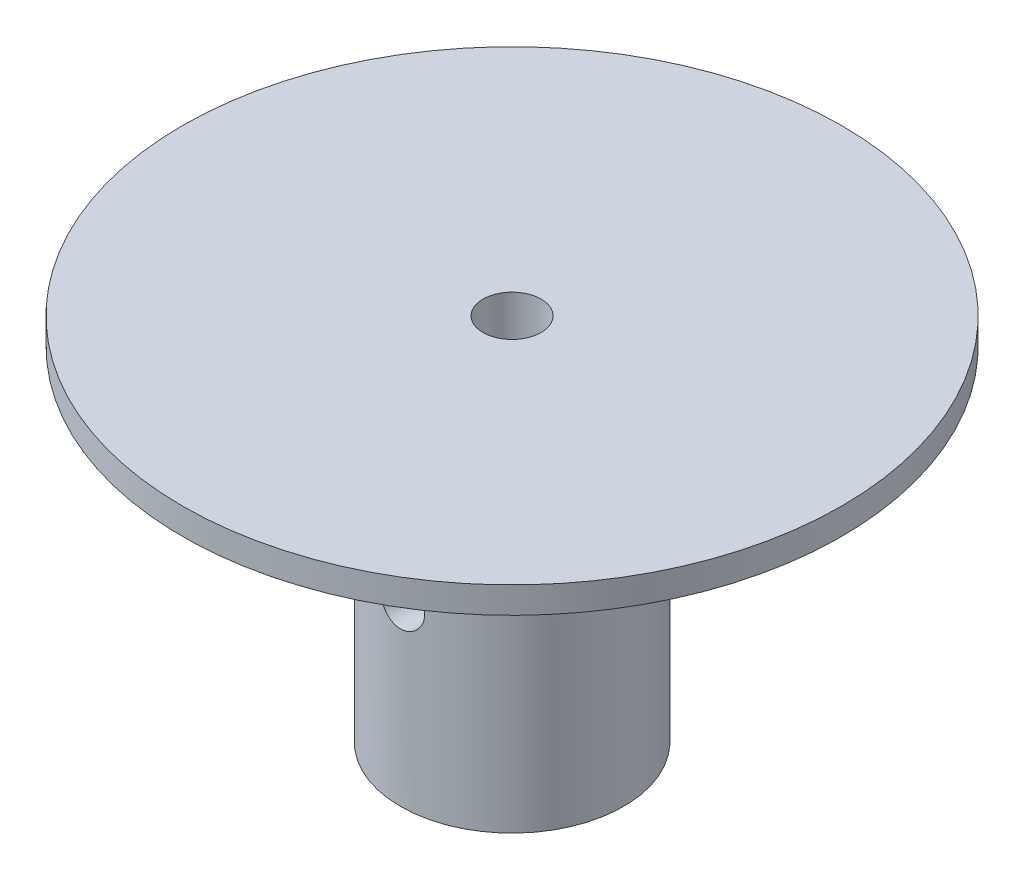
ISO-10303-21;
HEADER;
FILE_DESCRIPTION(('STEP AP214'),'2;1');
FILE_NAME('part.step','',(''),(''),'','','');
FILE_SCHEMA(('AUTOMOTIVE_DESIGN { 1 0 10303 214 1 1 1 1 }'));
ENDSEC;
DATA;
#1=APPLICATION_CONTEXT('core data for automotive mechanical design processes');
#2=APPLICATION_PROTOCOL_DEFINITION('international standard','automotive_design',2000,#1);
#3=PRODUCT_CONTEXT('',#1,'mechanical');
#4=PRODUCT('Part','Part','',(#3));
#5=PRODUCT_RELATED_PRODUCT_CATEGORY('part','',(#4));
#6=PRODUCT_DEFINITION_FORMATION('','',#4);
#7=PRODUCT_DEFINITION_CONTEXT('part definition',#1,'design');
#8=PRODUCT_DEFINITION('design','',#6,#7);
#9=PRODUCT_DEFINITION_SHAPE('','',#8);
#10=(LENGTH_UNIT() NAMED_UNIT(*) SI_UNIT(.MILLI.,.METRE.));
#11=(NAMED_UNIT(*) PLANE_ANGLE_UNIT() SI_UNIT($,.RADIAN.));
#12=(NAMED_UNIT(*) SI_UNIT($,.STERADIAN.) SOLID_ANGLE_UNIT());
#13=UNCERTAINTY_MEASURE_WITH_UNIT(LENGTH_MEASURE(1.E-05),#10,'distance_accuracy_value','');
#14=(GEOMETRIC_REPRESENTATION_CONTEXT(3) GLOBAL_UNCERTAINTY_ASSIGNED_CONTEXT((#13)) GLOBAL_UNIT_ASSIGNED_CONTEXT((#10,
#11,#12)) REPRESENTATION_CONTEXT('',''));
#15=CARTESIAN_POINT('',(0.,0.,0.));
#16=DIRECTION('',(0.,0.,1.));
#17=DIRECTION('',(1.,0.,0.));
#18=AXIS2_PLACEMENT_3D('',#15,#16,#17);
#19=CARTESIAN_POINT('',(0.,40.,0.));
#20=DIRECTION('',(0.,-1.,0.));
#21=DIRECTION('',(0.,0.,-1.));
#22=AXIS2_PLACEMENT_3D('',#19,#20,#21);
#23=CYLINDRICAL_SURFACE('',#22,12.7);
#24=CARTESIAN_POINT('',(0.,39.,0.));
#25=DIRECTION('',(0.,-1.,0.));
#26=DIRECTION('',(0.,0.,-1.));
#27=AXIS2_PLACEMENT_3D('',#24,#25,#26);
#28=CIRCLE('',#27,12.7);
#29=CARTESIAN_POINT('',(0.,39.,-12.7));
#30=VERTEX_POINT('',#29);
#31=EDGE_CURVE('E118',#30,#30,#28,.T.);
#32=ORIENTED_EDGE('',*,*,#31,.T.);
#33=EDGE_LOOP('',(#32));
#34=FACE_BOUND('',#33,.T.);
#35=CARTESIAN_POINT('',(0.,22.5,-12.7));
#36=CARTESIAN_POINT('',(-0.138987960865234,22.499994833943,-12.6999974468811));
#37=CARTESIAN_POINT('',(-0.278041713614196,22.4883702446647,-12.6976949339189));
#38=CARTESIAN_POINT('',(-0.552221840666648,22.4422141497609,-12.6887318036794));
#39=CARTESIAN_POINT('',(-0.687344952752516,22.4076641533403,-12.6820676685364));
#40=CARTESIAN_POINT('',(-0.949659697043477,22.3167634099156,-12.6651257812117));
#41=CARTESIAN_POINT('',(-1.07685868370594,22.2604332381561,-12.6548514403439));
#42=CARTESIAN_POINT('',(-1.31999070721838,22.1276315968935,-12.6318073542676));
#43=CARTESIAN_POINT('',(-1.43592447607421,22.0511614372721,-12.6190377713609));
#44=CARTESIAN_POINT('',(-1.65476803302417,21.879184913606,-12.5922220522898));
#45=CARTESIAN_POINT('',(-1.75750845008173,21.7834650672187,-12.5781626589771));
#46=CARTESIAN_POINT('',(-1.94558265987402,21.5761653040664,-12.5504488475412));
#47=CARTESIAN_POINT('',(-2.03091512197415,21.4645841759972,-12.5367944604441));
#48=CARTESIAN_POINT('',(-2.18246782558671,21.227516414781,-12.5113073631306));
#49=CARTESIAN_POINT('',(-2.24851348505254,21.1019161778105,-12.4994917196969));
#50=CARTESIAN_POINT('',(-2.35849956917044,20.8411305841508,-12.4792078209969));
#51=CARTESIAN_POINT('',(-2.40244210553341,20.7059461445354,-12.4707392459716));
#52=CARTESIAN_POINT('',(-2.46642634199944,20.4316492554968,-12.4582422803737));
#53=CARTESIAN_POINT('',(-2.48676474883637,20.2926085776543,-12.4541588183279));
#54=CARTESIAN_POINT('',(-2.50388482784342,20.0130330483538,-12.4507285909527));
#55=CARTESIAN_POINT('',(-2.50066883198495,19.8724983461853,-12.4513813567195));
#56=CARTESIAN_POINT('',(-2.47101146674484,19.596089327001,-12.4572997676681));
#57=CARTESIAN_POINT('',(-2.44490952078092,19.4601769331889,-12.4624979956958));
#58=CARTESIAN_POINT('',(-2.37075664445726,19.1946987657748,-12.4768155357255));
#59=CARTESIAN_POINT('',(-2.32270469551383,19.0651332870085,-12.4859350296917));
#60=CARTESIAN_POINT('',(-2.20568971494497,18.8150448093683,-12.5071368898427));
#61=CARTESIAN_POINT('',(-2.13659150045544,18.6945867440355,-12.5192383104004));
#62=CARTESIAN_POINT('',(-1.97954087249848,18.4668477222278,-12.5450281718732));
#63=CARTESIAN_POINT('',(-1.89158635727556,18.3595682367584,-12.5587167896218));
#64=CARTESIAN_POINT('',(-1.69749924075908,18.1592724337398,-12.5864311850058));
#65=CARTESIAN_POINT('',(-1.59107678296699,18.0665369977906,-12.6004586831339));
#66=CARTESIAN_POINT('',(-1.36403967125457,17.9001905415399,-12.6270518311294));
#67=CARTESIAN_POINT('',(-1.24342484607896,17.8265797520445,-12.6396174633531));
#68=CARTESIAN_POINT('',(-0.991119710985106,17.7005229032414,-12.6619004871253));
#69=CARTESIAN_POINT('',(-0.859413335279193,17.6481082058248,-12.6716136523715));
#70=CARTESIAN_POINT('',(-0.588830874890813,17.5662268760062,-12.6870651128115));
#71=CARTESIAN_POINT('',(-0.449955633135175,17.5367575521743,-12.6928038741834));
#72=CARTESIAN_POINT('',(-0.171392040916341,17.5019994294573,-12.6995952302307));
#73=CARTESIAN_POINT('',(-0.0317534277233666,17.4963261223005,-12.7007223350353));
#74=CARTESIAN_POINT('',(0.246476638338104,17.5082866111275,-12.6983700492024));
#75=CARTESIAN_POINT('',(0.385068147739182,17.5259191396664,-12.6948909090669));
#76=CARTESIAN_POINT('',(0.656034823048091,17.5836712660876,-12.6837636208141));
#77=CARTESIAN_POINT('',(0.788453517065809,17.6235942755498,-12.6761519352064));
#78=CARTESIAN_POINT('',(1.04471741581758,17.7245798107489,-12.6576098134253));
#79=CARTESIAN_POINT('',(1.16856199253419,17.7856438830167,-12.646679134465));
#80=CARTESIAN_POINT('',(1.40578877801717,17.9280149261848,-12.6225258491849));
#81=CARTESIAN_POINT('',(1.51902884538163,18.0095542826313,-12.6092775014321));
#82=CARTESIAN_POINT('',(1.73035680232957,18.1902492864937,-12.5820204588253));
#83=CARTESIAN_POINT('',(1.82844311973421,18.2894067594713,-12.5680116852818));
#84=CARTESIAN_POINT('',(2.00815737604346,18.5042712458316,-12.5405625275439));
#85=CARTESIAN_POINT('',(2.08952174237709,18.6202004198395,-12.5271335480784));
#86=CARTESIAN_POINT('',(2.23162326975849,18.8643064308326,-12.5026028828179));
#87=CARTESIAN_POINT('',(2.29236124216583,18.9924827858087,-12.4915011054867));
#88=CARTESIAN_POINT('',(2.39112242068542,19.2568084040906,-12.4729732664571));
#89=CARTESIAN_POINT('',(2.42926140651535,19.3929130349882,-12.4655285032328));
#90=CARTESIAN_POINT('',(2.48209472746247,19.6697604868739,-12.4551171742591));
#91=CARTESIAN_POINT('',(2.49679201245609,19.8105027219959,-12.4521500450518));
#92=CARTESIAN_POINT('',(2.50221823341316,20.0899855439399,-12.4510605246743));
#93=CARTESIAN_POINT('',(2.49336346367693,20.2287178885978,-12.4528539865424));
#94=CARTESIAN_POINT('',(2.45285380576288,20.5026744298686,-12.4608959273249));
#95=CARTESIAN_POINT('',(2.42119908817676,20.6378986527218,-12.4671443729065));
#96=CARTESIAN_POINT('',(2.33617123860446,20.9007460942606,-12.4833551743628));
#97=CARTESIAN_POINT('',(2.28284762082502,21.0283858865014,-12.4933090588546));
#98=CARTESIAN_POINT('',(2.15604281399342,21.2729727792321,-12.5158143109788));
#99=CARTESIAN_POINT('',(2.08256000241888,21.3899190180358,-12.5283658876678));
#100=CARTESIAN_POINT('',(1.91609430756191,21.611875251352,-12.5549107116211));
#101=CARTESIAN_POINT('',(1.82281018019679,21.7166569228888,-12.5689242991049));
#102=CARTESIAN_POINT('',(1.62001342859707,21.9092175370653,-12.5966666057201));
#103=CARTESIAN_POINT('',(1.51049708113706,21.9969925681635,-12.6103952586694));
#104=CARTESIAN_POINT('',(1.27701879640782,22.153881710985,-12.6361838431273));
#105=CARTESIAN_POINT('',(1.15292235481975,22.2227987681861,-12.6482255557717));
#106=CARTESIAN_POINT('',(0.894709355165153,22.3386927020578,-12.6691045662215));
#107=CARTESIAN_POINT('',(0.760602057026481,22.3856895699496,-12.6779447821414));
#108=CARTESIAN_POINT('',(0.521807507477838,22.4471931753729,-12.6896853850498));
#109=CARTESIAN_POINT('',(0.418489394757489,22.4669608090208,-12.6935309348549));
#110=CARTESIAN_POINT('',(0.21012668916486,22.4933659764926,-12.6986891693293));
#111=CARTESIAN_POINT('',(0.105082148392049,22.5000039058086,-12.7000019302911));
#112=CARTESIAN_POINT('',(0.,22.5,-12.7));
#113=B_SPLINE_CURVE_WITH_KNOTS('',3,(#35,#36,#37,#38,#39,#40,#41,#42,#43,#44,#45,#46,#47,#48,
#49,#50,#51,#52,#53,#54,#55,#56,#57,#58,#59,#60,#61,#62,#63,#64,#65,#66,#67,#68,#69,#70,#71,#72,
#73,#74,#75,#76,#77,#78,#79,#80,#81,#82,#83,#84,#85,#86,#87,#88,#89,#90,#91,#92,#93,#94,#95,#96,
#97,#98,#99,#100,#101,#102,#103,#104,#105,#106,#107,#108,#109,#110,#111,#112),.UNSPECIFIED.,.T.,
.F.,(4,2,2,2,2,2,2,2,2,2,2,2,2,2,2,2,2,2,2,2,2,2,2,2,2,2,2,2,2,2,2,2,2,2,2,2,2,2,4),(0.,
0.416579494379319,0.83349539562907,1.250018404242,1.66651432936132,2.08791289116745,
2.50934365190691,2.93447863552307,3.35957299443768,3.77926392337944,4.19891330195644,
4.61244214417561,5.02599017803351,5.44225259616542,5.8585614357622,6.28211919678174,
6.70568206927715,7.12986937539057,7.55400691798368,7.97126397817152,8.38849834753991,
8.80210980129147,9.21575151833291,9.63431870532569,10.0529292889163,10.4777029466109,
10.9024598934786,11.3250214655015,11.7475298586702,12.162620048428,12.577707132468,
12.991851013949,13.4060282377833,13.8270272251891,14.2481229280672,14.6734639753723,
15.098416349303,15.4133816644473,15.7283374920811),.UNSPECIFIED.);
#114=CARTESIAN_POINT('',(0.,22.5,-12.7));
#115=VERTEX_POINT('',#114);
#116=EDGE_CURVE('E80',#115,#115,#113,.T.);
#117=ORIENTED_EDGE('',*,*,#116,.T.);
#118=EDGE_LOOP('',(#117));
#119=FACE_BOUND('',#118,.T.);
#120=CARTESIAN_POINT('',(2.5,20.,12.4515059330187));
#121=CARTESIAN_POINT('',(2.49999481112705,19.8610414495521,12.4515086801221));
#122=CARTESIAN_POINT('',(2.48837497446621,19.7220170455003,12.4538573780391));
#123=CARTESIAN_POINT('',(2.44223946736303,19.4478978583915,12.4629851424746));
#124=CARTESIAN_POINT('',(2.4077051928492,19.312806361542,12.4697678088348));
#125=CARTESIAN_POINT('',(2.31685041377872,19.050558570704,12.4869662392917));
#126=CARTESIAN_POINT('',(2.26055122334489,18.9233946543711,12.497378448043));
#127=CARTESIAN_POINT('',(2.12782261174791,18.6803217474573,12.520658547066));
#128=CARTESIAN_POINT('',(2.05139442885632,18.5644120651519,12.5335262862678));
#129=CARTESIAN_POINT('',(1.87946092692868,18.3455427853087,12.5604645639528));
#130=CARTESIAN_POINT('',(1.78373269985198,18.242759846333,12.574547940937));
#131=CARTESIAN_POINT('',(1.57639813080684,18.0546031472773,12.6022175543974));
#132=CARTESIAN_POINT('',(1.46479069524084,17.9692305872324,12.6158037565521));
#133=CARTESIAN_POINT('',(1.22769842495422,17.8176347515814,12.6410864511423));
#134=CARTESIAN_POINT('',(1.10210450932241,17.7515790157313,12.6527660432642));
#135=CARTESIAN_POINT('',(0.841332590615542,17.6415725778787,12.6727754563176));
#136=CARTESIAN_POINT('',(0.706155457693169,17.5976198718548,12.6811055809224));
#137=CARTESIAN_POINT('',(0.431886955585737,17.5336161426488,12.6933867840068));
#138=CARTESIAN_POINT('',(0.292867655737869,17.5132669362844,12.6973924475675));
#139=CARTESIAN_POINT('',(0.0133344300821466,17.4961178427909,12.7007618216766));
#140=CARTESIAN_POINT('',(-0.127179354790816,17.4993157544115,12.700125966127));
#141=CARTESIAN_POINT('',(-0.403664952283927,17.5289433080601,12.6943263351925));
#142=CARTESIAN_POINT('',(-0.539672683317145,17.5550517909152,12.6892251568927));
#143=CARTESIAN_POINT('',(-0.805338097562944,17.6292503365518,12.6751385450115));
#144=CARTESIAN_POINT('',(-0.934995532160501,17.6773412591887,12.6661529594901));
#145=CARTESIAN_POINT('',(-1.18520000661034,17.794439265915,12.6452036155855));
#146=CARTESIAN_POINT('',(-1.30568628954387,17.8635728312919,12.6332219284483));
#147=CARTESIAN_POINT('',(-1.53346700125107,18.0207001864625,12.6076023172215));
#148=CARTESIAN_POINT('',(-1.64075995522044,18.1086960817541,12.5939642083084));
#149=CARTESIAN_POINT('',(-1.84101348780502,18.3028141146632,12.5662674519988));
#150=CARTESIAN_POINT('',(-1.93370138946085,18.4092172979028,12.5522055922691));
#151=CARTESIAN_POINT('',(-2.09996090738082,18.6361983869966,12.5254651226689));
#152=CARTESIAN_POINT('',(-2.17353218427706,18.7567765444369,12.5127865373575));
#153=CARTESIAN_POINT('',(-2.29955985610079,19.0090686565078,12.4902422331271));
#154=CARTESIAN_POINT('',(-2.35197327508455,19.1408046252188,12.4803822510996));
#155=CARTESIAN_POINT('',(-2.43384313158704,19.4114518467029,12.4646766055988));
#156=CARTESIAN_POINT('',(-2.46330245950125,19.5503621937235,12.4588304367142));
#157=CARTESIAN_POINT('',(-2.4980227883024,19.8289468624393,12.4519152716998));
#158=CARTESIAN_POINT('',(-2.5036770376827,19.9685702994464,12.4507686498012));
#159=CARTESIAN_POINT('',(-2.49168385683656,20.2467655631436,12.4531742025905));
#160=CARTESIAN_POINT('',(-2.47403770407636,20.3853374470672,12.4567261196766));
#161=CARTESIAN_POINT('',(-2.41628328577182,20.6561817297633,12.4680559446109));
#162=CARTESIAN_POINT('',(-2.37638411602492,20.7885005112891,12.4757944936513));
#163=CARTESIAN_POINT('',(-2.27547938701036,21.0445750326426,12.4945912857204));
#164=CARTESIAN_POINT('',(-2.21447213562044,21.1683300850071,12.5056497948833));
#165=CARTESIAN_POINT('',(-2.07218899901321,21.405487964045,12.5300154978533));
#166=CARTESIAN_POINT('',(-1.99066644201221,21.5187400054767,12.5433493717065));
#167=CARTESIAN_POINT('',(-1.80999661111269,21.7300998424273,12.5706897371341));
#168=CARTESIAN_POINT('',(-1.71084758260394,21.8282061284584,12.5846962955687));
#169=CARTESIAN_POINT('',(-1.49597623280194,22.0079749377214,12.612055139542));
#170=CARTESIAN_POINT('',(-1.38002987213275,22.089371933843,12.6253946368085));
#171=CARTESIAN_POINT('',(-1.13587968189558,22.2315306473536,12.6496958501384));
#172=CARTESIAN_POINT('',(-1.00767635682317,22.2922932135857,12.6606576640065));
#173=CARTESIAN_POINT('',(-0.743358639109908,22.3910685172656,12.6789137052668));
#174=CARTESIAN_POINT('',(-0.607292910036485,22.4292075532134,12.6862282566757));
#175=CARTESIAN_POINT('',(-0.330528424071527,22.4820541122338,12.6964526724649));
#176=CARTESIAN_POINT('',(-0.189830208886527,22.4967643651228,12.6993630499978));
#177=CARTESIAN_POINT('',(0.089666510028788,22.5022328127714,12.7004395609996));
#178=CARTESIAN_POINT('',(0.228457045023749,22.4933906828659,12.6986848601054));
#179=CARTESIAN_POINT('',(0.502533342438463,22.4528860030315,12.6907943203367));
#180=CARTESIAN_POINT('',(0.637819146112732,22.4212237218473,12.6846585330568));
#181=CARTESIAN_POINT('',(0.90080639549639,22.3361528153499,12.6686968948454));
#182=CARTESIAN_POINT('',(1.02852343151904,22.2827908076907,12.6588789577913));
#183=CARTESIAN_POINT('',(1.27324910849636,22.1558850280347,12.6366116123214));
#184=CARTESIAN_POINT('',(1.3902569348793,22.0823397225394,12.6241620039713));
#185=CARTESIAN_POINT('',(1.61222297950019,21.9157997215745,12.5977554078782));
#186=CARTESIAN_POINT('',(1.71696369041792,21.822518358058,12.5837778594152));
#187=CARTESIAN_POINT('',(1.9094429462079,21.6197446921146,12.5560147991884));
#188=CARTESIAN_POINT('',(1.99717746689241,21.5102485635618,12.5422293335918));
#189=CARTESIAN_POINT('',(2.15401609464184,21.2767918349234,12.5162541216447));
#190=CARTESIAN_POINT('',(2.22291750716131,21.1526929759027,12.5040824110959));
#191=CARTESIAN_POINT('',(2.33878154991404,20.8944762320704,12.4829322496606));
#192=CARTESIAN_POINT('',(2.3857642907382,20.7603676628607,12.4739508734245));
#193=CARTESIAN_POINT('',(2.44723352987207,20.5216093992876,12.4620117784397));
#194=CARTESIAN_POINT('',(2.46698593860908,20.4183310638183,12.4580962385279));
#195=CARTESIAN_POINT('',(2.49337092170777,20.2100476582587,12.4528423193853));
#196=CARTESIAN_POINT('',(2.50000392241381,20.1050426443924,12.4515038564066));
#197=CARTESIAN_POINT('',(2.5,20.,12.4515059330187));
#198=B_SPLINE_CURVE_WITH_KNOTS('',3,(#120,#121,#122,#123,#124,#125,#126,#127,#128,#129,#130,
#131,#132,#133,#134,#135,#136,#137,#138,#139,#140,#141,#142,#143,#144,#145,#146,#147,#148,#149,
#150,#151,#152,#153,#154,#155,#156,#157,#158,#159,#160,#161,#162,#163,#164,#165,#166,#167,#168,
#169,#170,#171,#172,#173,#174,#175,#176,#177,#178,#179,#180,#181,#182,#183,#184,#185,#186,#187,
#188,#189,#190,#191,#192,#193,#194,#195,#196,#197),.UNSPECIFIED.,.T.,.F.,(4,2,2,2,2,2,2,2,2,2,2,
2,2,2,2,2,2,2,2,2,2,2,2,2,2,2,2,2,2,2,2,2,2,2,2,2,2,2,4),(0.,0.416491094537396,
0.833320749709443,1.24974323837195,1.66614011602895,2.08765436758338,2.50919766279471,
2.93429547491188,3.35935473761564,3.77898363884539,4.19857331249353,4.61237350720318,
5.02618988932176,5.44254443830965,5.85894548688469,6.28237944373737,6.70582091708825,
7.13011821054206,7.55436206754056,7.97156943114998,8.3887539219269,8.80208290874242,
9.21544503761689,9.63403699431331,10.0526706427011,10.4775145683406,10.9023410149635,
11.3247729364698,11.7471556345077,12.1624165070907,12.5776724893764,12.9920410483319,
13.4064410991442,13.8273337128744,14.2483258014844,14.6736848638178,15.0986528838583,
15.4135003516563,15.7283375876167),.UNSPECIFIED.);
#199=CARTESIAN_POINT('',(2.5,20.,12.4515059330187));
#200=VERTEX_POINT('',#199);
#201=EDGE_CURVE('E74',#200,#200,#198,.T.);
#202=ORIENTED_EDGE('',*,*,#201,.T.);
#203=EDGE_LOOP('',(#202));
#204=FACE_BOUND('',#203,.T.);
#205=CARTESIAN_POINT('',(0.,0.,0.));
#206=DIRECTION('',(0.,1.,0.));
#207=DIRECTION('',(0.,0.,1.));
#208=AXIS2_PLACEMENT_3D('',#205,#206,#207);
#209=CIRCLE('',#208,12.7);
#210=CARTESIAN_POINT('',(0.,0.,12.7));
#211=VERTEX_POINT('',#210);
#212=EDGE_CURVE('E10',#211,#211,#209,.T.);
#213=ORIENTED_EDGE('',*,*,#212,.T.);
#214=EDGE_LOOP('',(#213));
#215=FACE_BOUND('',#214,.T.);
#216=ADVANCED_FACE('F32',(#34,#119,#204,#215),#23,.T.);
#217=CARTESIAN_POINT('',(0.,0.,0.));
#218=DIRECTION('',(0.,1.,0.));
#219=DIRECTION('',(0.,0.,1.));
#220=AXIS2_PLACEMENT_3D('',#217,#218,#219);
#221=PLANE('',#220);
#222=CARTESIAN_POINT('',(0.,0.,0.));
#223=DIRECTION('',(0.,-1.,0.));
#224=DIRECTION('',(0.,0.,-1.));
#225=AXIS2_PLACEMENT_3D('',#222,#223,#224);
#226=CIRCLE('',#225,3.302);
#227=CARTESIAN_POINT('',(0.,0.,-3.302));
#228=VERTEX_POINT('',#227);
#229=EDGE_CURVE('E87',#228,#228,#226,.T.);
#230=ORIENTED_EDGE('',*,*,#229,.F.);
#231=EDGE_LOOP('',(#230));
#232=FACE_BOUND('',#231,.T.);
#233=ORIENTED_EDGE('',*,*,#212,.F.);
#234=EDGE_LOOP('',(#233));
#235=FACE_BOUND('',#234,.T.);
#236=ADVANCED_FACE('F93',(#232,#235),#221,.F.);
#237=CARTESIAN_POINT('',(0.,42.,0.));
#238=DIRECTION('',(0.,-1.,0.));
#239=DIRECTION('',(0.,0.,-1.));
#240=AXIS2_PLACEMENT_3D('',#237,#238,#239);
#241=CYLINDRICAL_SURFACE('',#240,37.5);
#242=CARTESIAN_POINT('',(0.,42.,0.));
#243=DIRECTION('',(0.,1.,0.));
#244=DIRECTION('',(0.,0.,1.));
#245=AXIS2_PLACEMENT_3D('',#242,#243,#244);
#246=CIRCLE('',#245,37.5);
#247=CARTESIAN_POINT('',(0.,42.,37.5));
#248=VERTEX_POINT('',#247);
#249=EDGE_CURVE('E45',#248,#248,#246,.T.);
#250=ORIENTED_EDGE('',*,*,#249,.F.);
#251=EDGE_LOOP('',(#250));
#252=FACE_BOUND('',#251,.T.);
#253=CARTESIAN_POINT('',(0.,39.,0.));
#254=DIRECTION('',(0.,-1.,0.));
#255=DIRECTION('',(0.,0.,-1.));
#256=AXIS2_PLACEMENT_3D('',#253,#254,#255);
#257=CIRCLE('',#256,37.5);
#258=CARTESIAN_POINT('',(0.,39.,-37.5));
#259=VERTEX_POINT('',#258);
#260=EDGE_CURVE('E58',#259,#259,#257,.T.);
#261=ORIENTED_EDGE('',*,*,#260,.F.);
#262=EDGE_LOOP('',(#261));
#263=FACE_BOUND('',#262,.T.);
#264=ADVANCED_FACE('F96',(#252,#263),#241,.T.);
#265=CARTESIAN_POINT('',(0.,42.,0.));
#266=DIRECTION('',(0.,1.,0.));
#267=DIRECTION('',(0.,0.,1.));
#268=AXIS2_PLACEMENT_3D('',#265,#266,#267);
#269=PLANE('',#268);
#270=CARTESIAN_POINT('',(0.,42.,0.));
#271=DIRECTION('',(0.,-1.,0.));
#272=DIRECTION('',(0.,0.,-1.));
#273=AXIS2_PLACEMENT_3D('',#270,#271,#272);
#274=CIRCLE('',#273,3.302);
#275=CARTESIAN_POINT('',(0.,42.,-3.302));
#276=VERTEX_POINT('',#275);
#277=EDGE_CURVE('E50',#276,#276,#274,.T.);
#278=ORIENTED_EDGE('',*,*,#277,.T.);
#279=EDGE_LOOP('',(#278));
#280=FACE_BOUND('',#279,.T.);
#281=ORIENTED_EDGE('',*,*,#249,.T.);
#282=EDGE_LOOP('',(#281));
#283=FACE_BOUND('',#282,.T.);
#284=ADVANCED_FACE('F101',(#280,#283),#269,.T.);
#285=CARTESIAN_POINT('',(0.,42.,0.));
#286=DIRECTION('',(0.,-1.,0.));
#287=DIRECTION('',(0.,0.,-1.));
#288=AXIS2_PLACEMENT_3D('',#285,#286,#287);
#289=CYLINDRICAL_SURFACE('',#288,3.302);
#290=CARTESIAN_POINT('',(0.,22.5,-3.302));
#291=CARTESIAN_POINT('',(0.121781969016032,22.4999904141586,-3.30199078987009));
#292=CARTESIAN_POINT('',(0.243732538506427,22.4910305316945,-3.29519307148474));
#293=CARTESIAN_POINT('',(0.483764626519158,22.4557611701352,-3.26861406847526));
#294=CARTESIAN_POINT('',(0.601837190768569,22.4294141468793,-3.24880468812258));
#295=CARTESIAN_POINT('',(0.830020002285007,22.3611792850775,-3.19810165542555));
#296=CARTESIAN_POINT('',(0.940173349604511,22.3193846158862,-3.16727449069109));
#297=CARTESIAN_POINT('',(1.15115817550274,22.2222376102439,-3.09684144423133));
#298=CARTESIAN_POINT('',(1.25199147714961,22.1668879330137,-3.05723728452112));
#299=CARTESIAN_POINT('',(1.45217560106231,22.0387741490448,-2.96774328992524));
#300=CARTESIAN_POINT('',(1.55051581354736,21.9648689974858,-2.91723933251492));
#301=CARTESIAN_POINT('',(1.734219539165,21.8048145072982,-2.81192550405891));
#302=CARTESIAN_POINT('',(1.81956311657798,21.7186467428041,-2.75710920973492));
#303=CARTESIAN_POINT('',(1.9930632711521,21.5162441917855,-2.6352076115415));
#304=CARTESIAN_POINT('',(2.07814477911411,21.3974778158376,-2.56793159779422));
#305=CARTESIAN_POINT('',(2.2274943691998,21.1444646731817,-2.43949165658743));
#306=CARTESIAN_POINT('',(2.29178944510852,21.0102382931313,-2.3783198740128));
#307=CARTESIAN_POINT('',(2.37852180137822,20.7760942959946,-2.29090304588796));
#308=CARTESIAN_POINT('',(2.40773955548449,20.6804853721476,-2.2599107112914));
#309=CARTESIAN_POINT('',(2.45481135744054,20.4838164703873,-2.20869249088342));
#310=CARTESIAN_POINT('',(2.47269175110588,20.382769726662,-2.18844166195657));
#311=CARTESIAN_POINT('',(2.49595036176424,20.1763330832895,-2.16189305805504));
#312=CARTESIAN_POINT('',(2.50120756190434,20.0709109240359,-2.15573037087437));
#313=CARTESIAN_POINT('',(2.49832172469089,19.8604821221974,-2.15907239523565));
#314=CARTESIAN_POINT('',(2.49017510401914,19.7554755982497,-2.16858129635189));
#315=CARTESIAN_POINT('',(2.46293413963447,19.5612686069695,-2.19943190567302));
#316=CARTESIAN_POINT('',(2.44518649644049,19.4716263628245,-2.21930898294177));
#317=CARTESIAN_POINT('',(2.40078003268306,19.2968670738569,-2.26727372588125));
#318=CARTESIAN_POINT('',(2.37411227699775,19.2117546659767,-2.29536962064447));
#319=CARTESIAN_POINT('',(2.29320924423803,18.9940091100696,-2.37685212058367));
#320=CARTESIAN_POINT('',(2.23223474115647,18.8656444263829,-2.43494791348177));
#321=CARTESIAN_POINT('',(2.09122996193013,18.6228514020311,-2.55709267251183));
#322=CARTESIAN_POINT('',(2.01115251173172,18.5084586389751,-2.62115613302262));
#323=CARTESIAN_POINT('',(1.83050211015623,18.2912751980969,-2.75048382399022));
#324=CARTESIAN_POINT('',(1.72942175528395,18.1888949234093,-2.81573199626637));
#325=CARTESIAN_POINT('',(1.50898559869006,18.0015489302095,-2.9397466077225));
#326=CARTESIAN_POINT('',(1.38966465277665,17.9165507057494,-2.99852504898016));
#327=CARTESIAN_POINT('',(1.1589148362909,17.7816384905601,-3.09395210732547));
#328=CARTESIAN_POINT('',(1.05046553935493,17.7281160868627,-3.13268135984016));
#329=CARTESIAN_POINT('',(0.824129717692152,17.636596148882,-3.19967275714516));
#330=CARTESIAN_POINT('',(0.706248960528341,17.5985892120033,-3.22794124033732));
#331=CARTESIAN_POINT('',(0.463030695890506,17.5400544423145,-3.27172040314966));
#332=CARTESIAN_POINT('',(0.337649976827705,17.5196409904983,-3.28714757538125));
#333=CARTESIAN_POINT('',(0.0843129477535225,17.4981960940402,-3.30335796829276));
#334=CARTESIAN_POINT('',(-0.0436420584779797,17.4971550736397,-3.30414842387488));
#335=CARTESIAN_POINT('',(-0.283894588451845,17.5135668887026,-3.29173736387278));
#336=CARTESIAN_POINT('',(-0.396411895384662,17.5290675627635,-3.28001277081905));
#337=CARTESIAN_POINT('',(-0.616732887952455,17.5746544988436,-3.24580929619437));
#338=CARTESIAN_POINT('',(-0.724535637000199,17.604743644767,-3.22332828826633));
#339=CARTESIAN_POINT('',(-0.936110623825493,17.679085779176,-3.16846961257874));
#340=CARTESIAN_POINT('',(-1.03967662631433,17.7237226274542,-3.1358249460919));
#341=CARTESIAN_POINT('',(-1.23778914788732,17.8250809432171,-3.06304314833115));
#342=CARTESIAN_POINT('',(-1.33233434229084,17.8818041816125,-3.02290491919931));
#343=CARTESIAN_POINT('',(-1.52639931894563,18.0160051667783,-2.9303064961627));
#344=CARTESIAN_POINT('',(-1.62416342437884,18.0953633100529,-2.87690602941918));
#345=CARTESIAN_POINT('',(-1.80591854549301,18.2667062580848,-2.76643993838111));
#346=CARTESIAN_POINT('',(-1.88988026578198,18.3587171775174,-2.70936686712343));
#347=CARTESIAN_POINT('',(-2.01252328132782,18.5149835913133,-2.61843991360333));
#348=CARTESIAN_POINT('',(-2.0558561389497,18.57556363309,-2.58445740878054));
#349=CARTESIAN_POINT('',(-2.13719647258747,18.7007789354219,-2.51761332837111));
#350=CARTESIAN_POINT('',(-2.1752020230188,18.7654156501252,-2.48475216132853));
#351=CARTESIAN_POINT('',(-2.28072206048541,18.9651471572716,-2.38963988968239));
#352=CARTESIAN_POINT('',(-2.34007170851681,19.106482084045,-2.33060096019534));
#353=CARTESIAN_POINT('',(-2.41501435589452,19.3466548932854,-2.25225658843609));
#354=CARTESIAN_POINT('',(-2.43865538152235,19.4408650850553,-2.22640824157173));
#355=CARTESIAN_POINT('',(-2.47494608220274,19.6336508019674,-2.18599888095116));
#356=CARTESIAN_POINT('',(-2.48762160670336,19.7322154818468,-2.17141133043191));
#357=CARTESIAN_POINT('',(-2.50108586938434,19.931930519612,-2.15589891804576));
#358=CARTESIAN_POINT('',(-2.50179702561861,20.0330934964522,-2.15506322974335));
#359=CARTESIAN_POINT('',(-2.49106709516167,20.2339419422943,-2.16745037221404));
#360=CARTESIAN_POINT('',(-2.47961271699635,20.3336256743765,-2.18068857945979));
#361=CARTESIAN_POINT('',(-2.44242587237077,20.5460639903036,-2.22230646124243));
#362=CARTESIAN_POINT('',(-2.41450731184497,20.6579702236131,-2.25296955985656));
#363=CARTESIAN_POINT('',(-2.34507830240191,20.8738081921648,-2.32514803731577));
#364=CARTESIAN_POINT('',(-2.30353287745968,20.9777185480227,-2.36669128631703));
#365=CARTESIAN_POINT('',(-2.19029229449303,21.2148347084747,-2.47261982790221));
#366=CARTESIAN_POINT('',(-2.11313720659252,21.3442480077875,-2.53970023043761));
#367=CARTESIAN_POINT('',(-1.98171453131121,21.5259059234237,-2.64180486804704));
#368=CARTESIAN_POINT('',(-1.93524040319179,21.5844311468279,-2.67612034891647));
#369=CARTESIAN_POINT('',(-1.83713653455613,21.6972105521035,-2.74439514690605));
#370=CARTESIAN_POINT('',(-1.78550661579921,21.7514645861997,-2.77835445166797));
#371=CARTESIAN_POINT('',(-1.62156980677882,21.9088250316026,-2.87928052132979));
#372=CARTESIAN_POINT('',(-1.50124449574066,22.0050987143254,-2.94445674438601));
#373=CARTESIAN_POINT('',(-1.30633675636345,22.1329601156642,-3.03344900423103));
#374=CARTESIAN_POINT('',(-1.2389964823963,22.1728087208097,-3.06164076942048));
#375=CARTESIAN_POINT('',(-1.099758333642,22.2464927980807,-3.11436456735006));
#376=CARTESIAN_POINT('',(-1.02786271415048,22.2803312147004,-3.13889839122712));
#377=CARTESIAN_POINT('',(-0.848742920510308,22.3542649904138,-3.19294324793908));
#378=CARTESIAN_POINT('',(-0.739400750925921,22.3909859711728,-3.22019353142941));
#379=CARTESIAN_POINT('',(-0.514798809982923,22.4491569750207,-3.26361705850492));
#380=CARTESIAN_POINT('',(-0.399554945943792,22.4706459481343,-3.27981855108514));
#381=CARTESIAN_POINT('',(-0.236117781621348,22.4892740566056,-3.29388539688387));
#382=CARTESIAN_POINT('',(-0.189047283736594,22.4932897112693,-3.29692193431311));
#383=CARTESIAN_POINT('',(-0.0946597178109096,22.4986548334999,-3.3009812430753));
#384=CARTESIAN_POINT('',(-0.0473425988342973,22.5000037264847,-3.30200358042729));
#385=CARTESIAN_POINT('',(0.,22.5,-3.302));
#386=B_SPLINE_CURVE_WITH_KNOTS('',3,(#290,#291,#292,#293,#294,#295,#296,#297,#298,#299,#300,
#301,#302,#303,#304,#305,#306,#307,#308,#309,#310,#311,#312,#313,#314,#315,#316,#317,#318,#319,
#320,#321,#322,#323,#324,#325,#326,#327,#328,#329,#330,#331,#332,#333,#334,#335,#336,#337,#338,
#339,#340,#341,#342,#343,#344,#345,#346,#347,#348,#349,#350,#351,#352,#353,#354,#355,#356,#357,
#358,#359,#360,#361,#362,#363,#364,#365,#366,#367,#368,#369,#370,#371,#372,#373,#374,#375,#376,
#377,#378,#379,#380,#381,#382,#383,#384,#385),.UNSPECIFIED.,.T.,.F.,(4,2,2,2,2,2,2,2,2,2,2,2,2,
2,2,2,2,2,2,2,2,2,2,2,2,2,2,2,2,2,2,2,2,2,2,2,2,2,2,2,2,2,2,2,2,2,2,4),(0.,0.365141930360818,
0.731074905166608,1.09483591629257,1.458525621889,1.85604982557986,2.25417778489923,
2.7347240248706,3.21464368501402,3.52760984562705,3.83984604245357,4.15506385985542,
4.47036595988824,4.74990129998611,5.02971748851019,5.48779128425704,5.94700820540658,
6.41897749423823,6.89005592111001,7.26950175511891,7.64871729692472,8.03038003649889,
8.41185411584186,8.75281867515979,9.0938506651368,9.44472902439512,9.79565883011985,
10.2045253738816,10.6142488297634,10.8595848411658,11.1050093032051,11.5940968883828,
11.8945935227421,12.1943798379368,12.4961093485786,12.7981688537193,13.154217670831,
13.5111876036169,14.0032301601552,14.2497195868878,14.4962175379504,14.995002976422,
15.2441800473961,15.4932347034933,15.8472644471666,16.2003855972096,16.3423035236184,
16.4842520244213),.UNSPECIFIED.);
#387=CARTESIAN_POINT('',(0.,22.5,-3.302));
#388=VERTEX_POINT('',#387);
#389=EDGE_CURVE('E36',#388,#388,#386,.T.);
#390=ORIENTED_EDGE('',*,*,#389,.T.);
#391=EDGE_LOOP('',(#390));
#392=FACE_BOUND('',#391,.T.);
#393=CARTESIAN_POINT('',(2.5,20.,2.15712864706768));
#394=CARTESIAN_POINT('',(2.50000095152616,20.0580976324,2.15712668163331));
#395=CARTESIAN_POINT('',(2.4979688242131,20.1161856431047,2.15948991535265));
#396=CARTESIAN_POINT('',(2.48991207388301,20.2317283569563,2.16877303423467));
#397=CARTESIAN_POINT('',(2.48388571740443,20.2891827741178,2.17569489779569));
#398=CARTESIAN_POINT('',(2.45999800773263,20.4600182680204,2.20277508290161));
#399=CARTESIAN_POINT('',(2.43632898360835,20.5716342881273,2.22924545401406));
#400=CARTESIAN_POINT('',(2.36924664786609,20.8093083115435,2.30057992438861));
#401=CARTESIAN_POINT('',(2.32278336145878,20.9336453311907,2.34810013162966));
#402=CARTESIAN_POINT('',(2.21290538223335,21.1705237850999,2.4519356667738));
#403=CARTESIAN_POINT('',(2.14946827790624,21.283049348528,2.5082625815099));
#404=CARTESIAN_POINT('',(2.00533785182249,21.498603883666,2.62500218514936));
#405=CARTESIAN_POINT('',(1.92427758721719,21.6013512041921,2.6854794229045));
#406=CARTESIAN_POINT('',(1.74650558887527,21.793549519001,2.80434451619585));
#407=CARTESIAN_POINT('',(1.64980733166627,21.8830118358337,2.86273411837843));
#408=CARTESIAN_POINT('',(1.44561803683151,22.043611702055,2.97089088738405));
#409=CARTESIAN_POINT('',(1.3387466912813,22.1153586840025,3.02091637180853));
#410=CARTESIAN_POINT('',(1.11197464180535,22.2428479396262,3.11152041814457));
#411=CARTESIAN_POINT('',(0.992076663038156,22.2985935519198,3.15210095037038));
#412=CARTESIAN_POINT('',(0.803812047877223,22.3682150929228,3.20334267065234));
#413=CARTESIAN_POINT('',(0.739299039956372,22.3891606882922,3.21887318563402));
#414=CARTESIAN_POINT('',(0.60806563186312,22.4258791298158,3.24621957875502));
#415=CARTESIAN_POINT('',(0.541346462774471,22.4416548090015,3.25803749119381));
#416=CARTESIAN_POINT('',(0.406306708196902,22.4677192330645,3.27761622485864));
#417=CARTESIAN_POINT('',(0.33798737885914,22.4780121406249,3.28538012392339));
#418=CARTESIAN_POINT('',(0.200409893039723,22.4929161805906,3.29663661671482));
#419=CARTESIAN_POINT('',(0.131151908090463,22.4975283373267,3.3001299804868));
#420=CARTESIAN_POINT('',(-0.0557463231413156,22.5021304702918,3.30361088513888));
#421=CARTESIAN_POINT('',(-0.173667180817782,22.4967052498365,3.29949344811879));
#422=CARTESIAN_POINT('',(-0.406427611426574,22.4695297459927,3.27897947759652));
#423=CARTESIAN_POINT('',(-0.521267120242613,22.4477791231799,3.26258268879218));
#424=CARTESIAN_POINT('',(-0.741401396889812,22.3901626112198,3.21958483234725));
#425=CARTESIAN_POINT('',(-0.846880598512867,22.3547483775537,3.19331090595125));
#426=CARTESIAN_POINT('',(-1.05012321585727,22.2714138044608,3.13236633324164));
#427=CARTESIAN_POINT('',(-1.14788528749491,22.2234912927133,3.09769422848648));
#428=CARTESIAN_POINT('',(-1.3468584916618,22.1096895476557,3.01698036821429));
#429=CARTESIAN_POINT('',(-1.44682250149154,22.0422752681519,2.97004204550784));
#430=CARTESIAN_POINT('',(-1.63461087433392,21.8953342101844,2.87098392614147));
#431=CARTESIAN_POINT('',(-1.7224206422716,21.8157931062283,2.81885802699206));
#432=CARTESIAN_POINT('',(-1.90199286463555,21.6286527478506,2.70172398017072));
#433=CARTESIAN_POINT('',(-1.99093656284927,21.5186358459535,2.63624947134951));
#434=CARTESIAN_POINT('',(-2.14979581607445,21.2839228716828,2.50837407012684));
#435=CARTESIAN_POINT('',(-2.21971579125996,21.1592302188917,2.44597246649842));
#436=CARTESIAN_POINT('',(-2.32197701515499,20.9323427722459,2.34843595372471));
#437=CARTESIAN_POINT('',(-2.3593589524919,20.8336132234099,2.31055683181314));
#438=CARTESIAN_POINT('',(-2.42187245676807,20.6292013404891,2.24494996519112));
#439=CARTESIAN_POINT('',(-2.44703321036085,20.5235362624384,2.2171980744634));
#440=CARTESIAN_POINT('',(-2.48068094228706,20.3237680537336,2.17944407359404));
#441=CARTESIAN_POINT('',(-2.4911450584356,20.2304047294315,2.16736038344006));
#442=CARTESIAN_POINT('',(-2.50141071102504,20.0423349192352,2.15550936620426));
#443=CARTESIAN_POINT('',(-2.50122039430786,19.9476295149528,2.15573262869018));
#444=CARTESIAN_POINT('',(-2.49021866007488,19.7599048375276,2.16842650498543));
#445=CARTESIAN_POINT('',(-2.47942800223987,19.6668826306214,2.18087318047962));
#446=CARTESIAN_POINT('',(-2.44802686768985,19.4844781097394,2.21605807520187));
#447=CARTESIAN_POINT('',(-2.42740035915944,19.3951019977771,2.23881309333912));
#448=CARTESIAN_POINT('',(-2.36547510393948,19.1800502618702,2.30447197900488));
#449=CARTESIAN_POINT('',(-2.31901227043393,19.0572375875769,2.35181423870486));
#450=CARTESIAN_POINT('',(-2.20947364337542,18.8231361220393,2.4550175018481));
#451=CARTESIAN_POINT('',(-2.14636082277232,18.711873795223,2.51089737360804));
#452=CARTESIAN_POINT('',(-2.00217334766963,18.4971253791232,2.62743823891883));
#453=CARTESIAN_POINT('',(-1.92051356207083,18.3940877450527,2.68819995747766));
#454=CARTESIAN_POINT('',(-1.74141556463339,18.2014629433978,2.80753394038447));
#455=CARTESIAN_POINT('',(-1.64399233648537,18.1118631570099,2.86610821952496));
#456=CARTESIAN_POINT('',(-1.43893533522251,17.951691973942,2.97413184621024));
#457=CARTESIAN_POINT('',(-1.33201882241116,17.8804122208701,3.02388471558904));
#458=CARTESIAN_POINT('',(-1.10524694089504,17.7538420662949,3.11391225344874));
#459=CARTESIAN_POINT('',(-0.985394601406622,17.6985479325057,3.15418913395228));
#460=CARTESIAN_POINT('',(-0.797279153227732,17.6295811208927,3.20497303943298));
#461=CARTESIAN_POINT('',(-0.732831803221418,17.608851453569,3.22034946752347));
#462=CARTESIAN_POINT('',(-0.601756676438712,17.5725519043837,3.24739276612612));
#463=CARTESIAN_POINT('',(-0.53513011109753,17.5569792075577,3.2590616602772));
#464=CARTESIAN_POINT('',(-0.4003005391124,17.5313032195719,3.27835262408926));
#465=CARTESIAN_POINT('',(-0.332098728821762,17.5211959113614,3.28597766589488));
#466=CARTESIAN_POINT('',(-0.194780375212865,17.5066417414463,3.29697109634129));
#467=CARTESIAN_POINT('',(-0.12566399659358,17.5021938742159,3.30034024113628));
#468=CARTESIAN_POINT('',(0.0609722404171776,17.4979968203808,3.30351457552728));
#469=CARTESIAN_POINT('',(0.17875423906268,17.503660127248,3.29921658760935));
#470=CARTESIAN_POINT('',(0.411194393370363,17.5312657934277,3.27837998057892));
#471=CARTESIAN_POINT('',(0.525852468815439,17.5532085703618,3.26184104744608));
#472=CARTESIAN_POINT('',(0.74576505950169,17.6111942837517,3.21857678950186));
#473=CARTESIAN_POINT('',(0.85119627194473,17.6468074932346,3.19216249650106));
#474=CARTESIAN_POINT('',(1.05431356395145,17.7305274452221,3.13095764083155));
#475=CARTESIAN_POINT('',(1.15199835952812,17.7786362532754,3.09616569338836));
#476=CARTESIAN_POINT('',(1.35086260709721,17.8928660516603,3.01519102626575));
#477=CARTESIAN_POINT('',(1.45078393112333,17.9605304957572,2.968109248521));
#478=CARTESIAN_POINT('',(1.63845535672643,18.1079811500873,2.86879204212027));
#479=CARTESIAN_POINT('',(1.72619028066956,18.1877822215021,2.81655032304228));
#480=CARTESIAN_POINT('',(1.90556430629425,18.3755127695405,2.69920507005855));
#481=CARTESIAN_POINT('',(1.99437568221602,18.4858631414316,2.63364468227731));
#482=CARTESIAN_POINT('',(2.15290244697927,18.7212737896257,2.50570353934982));
#483=CARTESIAN_POINT('',(2.22262384917928,18.8463294159762,2.44332178798145));
#484=CARTESIAN_POINT('',(2.32368953543875,19.0721221667104,2.34671018620598));
#485=CARTESIAN_POINT('',(2.36029331502001,19.169258887209,2.30958549511723));
#486=CARTESIAN_POINT('',(2.42164116722582,19.3702264910762,2.24518327200806));
#487=CARTESIAN_POINT('',(2.44641887989294,19.4740374217273,2.21787786367144));
#488=CARTESIAN_POINT('',(2.47618923768003,19.6488177865288,2.18448984153521));
#489=CARTESIAN_POINT('',(2.48508346319983,19.7183539700627,2.17431388762413));
#490=CARTESIAN_POINT('',(2.49698746262264,19.8585984011807,2.16063539662987));
#491=CARTESIAN_POINT('',(2.49999884217516,19.9293063236384,2.15713103862435));
#492=CARTESIAN_POINT('',(2.5,20.,2.15712864706768));
#493=B_SPLINE_CURVE_WITH_KNOTS('',3,(#393,#394,#395,#396,#397,#398,#399,#400,#401,#402,#403,
#404,#405,#406,#407,#408,#409,#410,#411,#412,#413,#414,#415,#416,#417,#418,#419,#420,#421,#422,
#423,#424,#425,#426,#427,#428,#429,#430,#431,#432,#433,#434,#435,#436,#437,#438,#439,#440,#441,
#442,#443,#444,#445,#446,#447,#448,#449,#450,#451,#452,#453,#454,#455,#456,#457,#458,#459,#460,
#461,#462,#463,#464,#465,#466,#467,#468,#469,#470,#471,#472,#473,#474,#475,#476,#477,#478,#479,
#480,#481,#482,#483,#484,#485,#486,#487,#488,#489,#490,#491,#492),.UNSPECIFIED.,.T.,.F.,(4,2,2,
2,2,2,2,2,2,2,2,2,2,2,2,2,2,2,2,2,2,2,2,2,2,2,2,2,2,2,2,2,2,2,2,2,2,2,2,2,2,2,2,2,2,2,2,2,2,4),
(0.,0.174190722061297,0.348457090960757,0.697688216669978,1.11841045233792,1.53969095669202,
1.97076704295892,2.40147359644886,2.81418577128824,3.2268117727978,3.43528844614424,
3.6436506858263,3.85185450441255,4.0600207750054,4.41239036010468,4.7647672715851,
5.10637600690226,5.44804410914485,5.83479700149355,6.22201035901294,6.68785976751439,
7.15360084299644,7.48904527332328,7.82368460687868,8.10656072403534,8.38922054478927,
8.67132790659787,8.95389666552411,9.37033443361185,9.78770621925705,10.2207393781839,
10.6533633166007,11.0651618367674,11.4768641333667,11.6848621752636,11.8927464922658,
12.1004778062659,12.3081722070121,12.6601851896692,13.0122072029259,13.3539663541964,
13.6957820349666,14.0829826904101,14.4706613444584,14.9370974783415,15.4033865149531,
15.7331498174829,16.0619694114752,16.2739839878385,16.4859406893752),.UNSPECIFIED.);
#494=CARTESIAN_POINT('',(2.5,20.,2.15712864706768));
#495=VERTEX_POINT('',#494);
#496=EDGE_CURVE('E53',#495,#495,#493,.T.);
#497=ORIENTED_EDGE('',*,*,#496,.T.);
#498=EDGE_LOOP('',(#497));
#499=FACE_BOUND('',#498,.T.);
#500=ORIENTED_EDGE('',*,*,#277,.F.);
#501=EDGE_LOOP('',(#500));
#502=FACE_BOUND('',#501,.T.);
#503=ORIENTED_EDGE('',*,*,#229,.T.);
#504=EDGE_LOOP('',(#503));
#505=FACE_BOUND('',#504,.T.);
#506=ADVANCED_FACE('F59',(#392,#499,#502,#505),#289,.F.);
#507=CARTESIAN_POINT('',(0.,20.,-37.5));
#508=DIRECTION('',(0.,0.,1.));
#509=DIRECTION('',(1.,0.,0.));
#510=AXIS2_PLACEMENT_3D('',#507,#508,#509);
#511=CYLINDRICAL_SURFACE('',#510,2.5);
#512=ORIENTED_EDGE('',*,*,#496,.F.);
#513=EDGE_LOOP('',(#512));
#514=FACE_BOUND('',#513,.T.);
#515=ORIENTED_EDGE('',*,*,#201,.F.);
#516=EDGE_LOOP('',(#515));
#517=FACE_BOUND('',#516,.T.);
#518=ADVANCED_FACE('F67',(#514,#517),#511,.F.);
#519=ORIENTED_EDGE('',*,*,#389,.F.);
#520=EDGE_LOOP('',(#519));
#521=FACE_BOUND('',#520,.T.);
#522=ORIENTED_EDGE('',*,*,#116,.F.);
#523=EDGE_LOOP('',(#522));
#524=FACE_BOUND('',#523,.T.);
#525=ADVANCED_FACE('F62',(#521,#524),#511,.F.);
#526=CARTESIAN_POINT('',(0.,39.,0.));
#527=DIRECTION('',(0.,-1.,0.));
#528=DIRECTION('',(0.,0.,-1.));
#529=AXIS2_PLACEMENT_3D('',#526,#527,#528);
#530=PLANE('',#529);
#531=ORIENTED_EDGE('',*,*,#260,.T.);
#532=EDGE_LOOP('',(#531));
#533=FACE_BOUND('',#532,.T.);
#534=ORIENTED_EDGE('',*,*,#31,.F.);
#535=EDGE_LOOP('',(#534));
#536=FACE_BOUND('',#535,.T.);
#537=ADVANCED_FACE('F66',(#533,#536),#530,.T.);
#538=CLOSED_SHELL('',(#216,#236,#264,#284,#506,#518,#525,#537));
#539=MANIFOLD_SOLID_BREP('B2',#538);
#540=ADVANCED_BREP_SHAPE_REPRESENTATION('',(#18,#539),#14);
#541=SHAPE_DEFINITION_REPRESENTATION(#9,#540);
ENDSEC;
END-ISO-10303-21;
